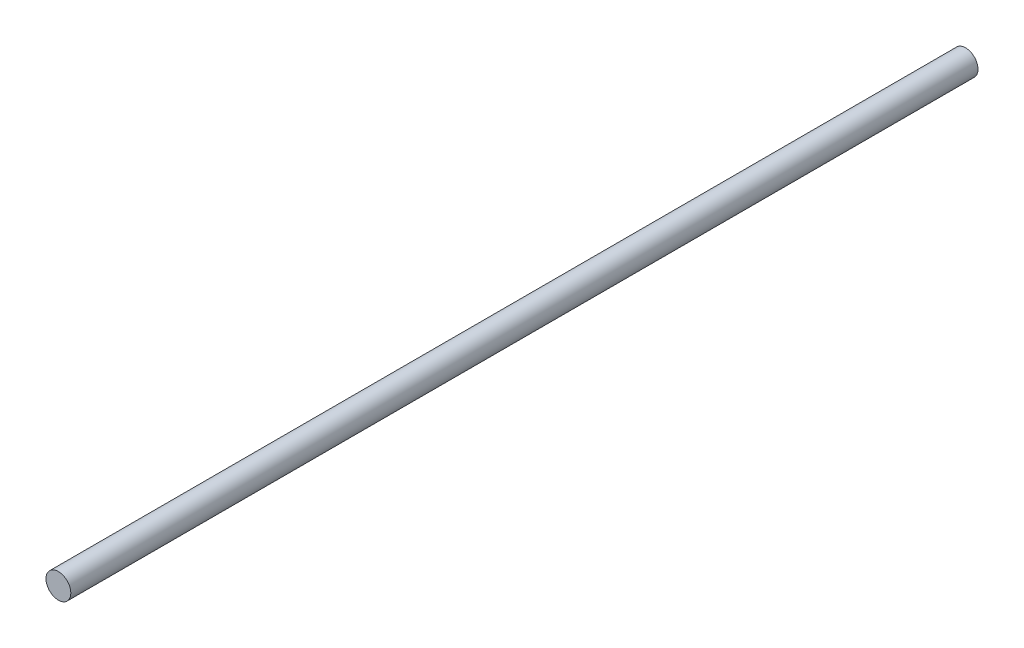
ISO-10303-21;
HEADER;
FILE_DESCRIPTION(('STEP AP214'),'2;1');
FILE_NAME('part.step','',(''),(''),'','','');
FILE_SCHEMA(('AUTOMOTIVE_DESIGN { 1 0 10303 214 1 1 1 1 }'));
ENDSEC;
DATA;
#1=APPLICATION_CONTEXT('core data for automotive mechanical design processes');
#2=APPLICATION_PROTOCOL_DEFINITION('international standard','automotive_design',2000,#1);
#3=PRODUCT_CONTEXT('',#1,'mechanical');
#4=PRODUCT('Part','Part','',(#3));
#5=PRODUCT_RELATED_PRODUCT_CATEGORY('part','',(#4));
#6=PRODUCT_DEFINITION_FORMATION('','',#4);
#7=PRODUCT_DEFINITION_CONTEXT('part definition',#1,'design');
#8=PRODUCT_DEFINITION('design','',#6,#7);
#9=PRODUCT_DEFINITION_SHAPE('','',#8);
#10=(LENGTH_UNIT() NAMED_UNIT(*) SI_UNIT(.MILLI.,.METRE.));
#11=(NAMED_UNIT(*) PLANE_ANGLE_UNIT() SI_UNIT($,.RADIAN.));
#12=(NAMED_UNIT(*) SI_UNIT($,.STERADIAN.) SOLID_ANGLE_UNIT());
#13=UNCERTAINTY_MEASURE_WITH_UNIT(LENGTH_MEASURE(1.E-05),#10,'distance_accuracy_value','');
#14=(GEOMETRIC_REPRESENTATION_CONTEXT(3) GLOBAL_UNCERTAINTY_ASSIGNED_CONTEXT((#13)) GLOBAL_UNIT_ASSIGNED_CONTEXT((#10,
#11,#12)) REPRESENTATION_CONTEXT('',''));
#15=CARTESIAN_POINT('',(0.,0.,0.));
#16=DIRECTION('',(0.,0.,1.));
#17=DIRECTION('',(1.,0.,0.));
#18=AXIS2_PLACEMENT_3D('',#15,#16,#17);
#19=CARTESIAN_POINT('',(0.,0.,48.26));
#20=DIRECTION('',(0.,0.,-1.));
#21=DIRECTION('',(-1.,0.,0.));
#22=AXIS2_PLACEMENT_3D('',#19,#20,#21);
#23=CYLINDRICAL_SURFACE('',#22,0.6604);
#24=CARTESIAN_POINT('',(0.,0.,48.26));
#25=DIRECTION('',(0.,0.,1.));
#26=DIRECTION('',(1.,0.,0.));
#27=AXIS2_PLACEMENT_3D('',#24,#25,#26);
#28=CIRCLE('',#27,0.6604);
#29=CARTESIAN_POINT('',(0.6604,0.,48.26));
#30=VERTEX_POINT('',#29);
#31=EDGE_CURVE('E10',#30,#30,#28,.T.);
#32=ORIENTED_EDGE('',*,*,#31,.F.);
#33=EDGE_LOOP('',(#32));
#34=FACE_BOUND('',#33,.T.);
#35=CARTESIAN_POINT('',(0.,0.,0.));
#36=DIRECTION('',(0.,0.,1.));
#37=DIRECTION('',(1.,0.,0.));
#38=AXIS2_PLACEMENT_3D('',#35,#36,#37);
#39=CIRCLE('',#38,0.6604);
#40=CARTESIAN_POINT('',(0.6604,0.,0.));
#41=VERTEX_POINT('',#40);
#42=EDGE_CURVE('E35',#41,#41,#39,.T.);
#43=ORIENTED_EDGE('',*,*,#42,.T.);
#44=EDGE_LOOP('',(#43));
#45=FACE_BOUND('',#44,.T.);
#46=ADVANCED_FACE('F32',(#34,#45),#23,.T.);
#47=CARTESIAN_POINT('',(0.,0.,48.26));
#48=DIRECTION('',(0.,0.,1.));
#49=DIRECTION('',(1.,0.,0.));
#50=AXIS2_PLACEMENT_3D('',#47,#48,#49);
#51=PLANE('',#50);
#52=ORIENTED_EDGE('',*,*,#31,.T.);
#53=EDGE_LOOP('',(#52));
#54=FACE_BOUND('',#53,.T.);
#55=ADVANCED_FACE('F47',(#54),#51,.T.);
#56=CARTESIAN_POINT('',(0.,0.,0.));
#57=DIRECTION('',(0.,0.,1.));
#58=DIRECTION('',(1.,0.,0.));
#59=AXIS2_PLACEMENT_3D('',#56,#57,#58);
#60=PLANE('',#59);
#61=ORIENTED_EDGE('',*,*,#42,.F.);
#62=EDGE_LOOP('',(#61));
#63=FACE_BOUND('',#62,.T.);
#64=ADVANCED_FACE('F45',(#63),#60,.F.);
#65=CLOSED_SHELL('',(#46,#55,#64));
#66=MANIFOLD_SOLID_BREP('B2',#65);
#67=ADVANCED_BREP_SHAPE_REPRESENTATION('',(#18,#66),#14);
#68=SHAPE_DEFINITION_REPRESENTATION(#9,#67);
ENDSEC;
END-ISO-10303-21;
